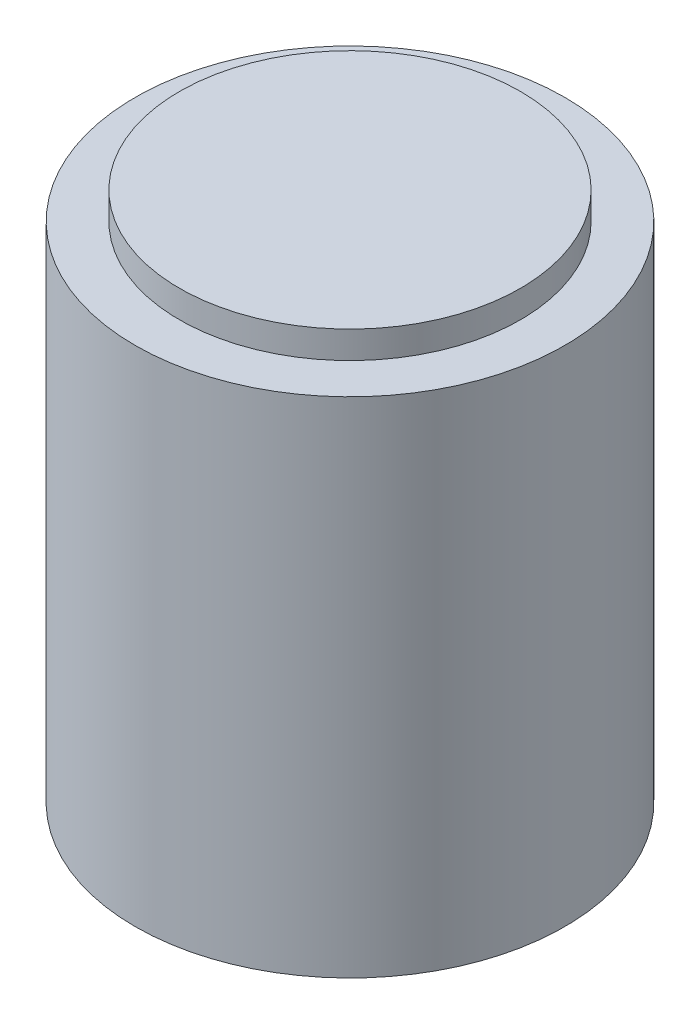
ISO-10303-21;
HEADER;
FILE_DESCRIPTION(('STEP AP214'),'2;1');
FILE_NAME('part.step','',(''),(''),'','','');
FILE_SCHEMA(('AUTOMOTIVE_DESIGN { 1 0 10303 214 1 1 1 1 }'));
ENDSEC;
DATA;
#1=APPLICATION_CONTEXT('core data for automotive mechanical design processes');
#2=APPLICATION_PROTOCOL_DEFINITION('international standard','automotive_design',2000,#1);
#3=PRODUCT_CONTEXT('',#1,'mechanical');
#4=PRODUCT('Part','Part','',(#3));
#5=PRODUCT_RELATED_PRODUCT_CATEGORY('part','',(#4));
#6=PRODUCT_DEFINITION_FORMATION('','',#4);
#7=PRODUCT_DEFINITION_CONTEXT('part definition',#1,'design');
#8=PRODUCT_DEFINITION('design','',#6,#7);
#9=PRODUCT_DEFINITION_SHAPE('','',#8);
#10=(LENGTH_UNIT() NAMED_UNIT(*) SI_UNIT(.MILLI.,.METRE.));
#11=(NAMED_UNIT(*) PLANE_ANGLE_UNIT() SI_UNIT($,.RADIAN.));
#12=(NAMED_UNIT(*) SI_UNIT($,.STERADIAN.) SOLID_ANGLE_UNIT());
#13=UNCERTAINTY_MEASURE_WITH_UNIT(LENGTH_MEASURE(1.E-05),#10,'distance_accuracy_value','');
#14=(GEOMETRIC_REPRESENTATION_CONTEXT(3) GLOBAL_UNCERTAINTY_ASSIGNED_CONTEXT((#13)) GLOBAL_UNIT_ASSIGNED_CONTEXT((#10,
#11,#12)) REPRESENTATION_CONTEXT('',''));
#15=CARTESIAN_POINT('',(0.,0.,0.));
#16=DIRECTION('',(0.,0.,1.));
#17=DIRECTION('',(1.,0.,0.));
#18=AXIS2_PLACEMENT_3D('',#15,#16,#17);
#19=CARTESIAN_POINT('',(0.,38.9,0.));
#20=DIRECTION('',(0.,1.,0.));
#21=DIRECTION('',(0.,0.,1.));
#22=AXIS2_PLACEMENT_3D('',#19,#20,#21);
#23=PLANE('',#22);
#24=CARTESIAN_POINT('',(0.,38.9,0.));
#25=DIRECTION('',(0.,-1.,0.));
#26=DIRECTION('',(0.,0.,-1.));
#27=AXIS2_PLACEMENT_3D('',#24,#25,#26);
#28=CIRCLE('',#27,12.5);
#29=CARTESIAN_POINT('',(0.,38.9,-12.5));
#30=VERTEX_POINT('',#29);
#31=EDGE_CURVE('E10',#30,#30,#28,.T.);
#32=ORIENTED_EDGE('',*,*,#31,.F.);
#33=EDGE_LOOP('',(#32));
#34=FACE_BOUND('',#33,.T.);
#35=ADVANCED_FACE('F31',(#34),#23,.T.);
#36=CARTESIAN_POINT('',(0.,0.,0.));
#37=DIRECTION('',(0.,-1.,0.));
#38=DIRECTION('',(0.,0.,-1.));
#39=AXIS2_PLACEMENT_3D('',#36,#37,#38);
#40=CYLINDRICAL_SURFACE('',#39,12.5);
#41=ORIENTED_EDGE('',*,*,#31,.T.);
#42=EDGE_LOOP('',(#41));
#43=FACE_BOUND('',#42,.T.);
#44=CARTESIAN_POINT('',(0.,36.9,0.));
#45=DIRECTION('',(0.,-1.,0.));
#46=DIRECTION('',(0.,0.,-1.));
#47=AXIS2_PLACEMENT_3D('',#44,#45,#46);
#48=CIRCLE('',#47,12.5);
#49=CARTESIAN_POINT('',(0.,36.9,-12.5));
#50=VERTEX_POINT('',#49);
#51=EDGE_CURVE('E37',#50,#50,#48,.T.);
#52=ORIENTED_EDGE('',*,*,#51,.F.);
#53=EDGE_LOOP('',(#52));
#54=FACE_BOUND('',#53,.T.);
#55=ADVANCED_FACE('F63',(#43,#54),#40,.T.);
#56=CARTESIAN_POINT('',(12.5,36.9,0.));
#57=DIRECTION('',(0.,1.,0.));
#58=DIRECTION('',(0.,0.,1.));
#59=AXIS2_PLACEMENT_3D('',#56,#57,#58);
#60=PLANE('',#59);
#61=ORIENTED_EDGE('',*,*,#51,.T.);
#62=EDGE_LOOP('',(#61));
#63=FACE_BOUND('',#62,.T.);
#64=CARTESIAN_POINT('',(0.,36.9,0.));
#65=DIRECTION('',(0.,-1.,0.));
#66=DIRECTION('',(0.,0.,-1.));
#67=AXIS2_PLACEMENT_3D('',#64,#65,#66);
#68=CIRCLE('',#67,15.75);
#69=CARTESIAN_POINT('',(0.,36.9,-15.75));
#70=VERTEX_POINT('',#69);
#71=EDGE_CURVE('E41',#70,#70,#68,.T.);
#72=ORIENTED_EDGE('',*,*,#71,.F.);
#73=EDGE_LOOP('',(#72));
#74=FACE_BOUND('',#73,.T.);
#75=ADVANCED_FACE('F55',(#63,#74),#60,.T.);
#76=CARTESIAN_POINT('',(0.,0.,0.));
#77=DIRECTION('',(0.,-1.,0.));
#78=DIRECTION('',(0.,0.,-1.));
#79=AXIS2_PLACEMENT_3D('',#76,#77,#78);
#80=CYLINDRICAL_SURFACE('',#79,15.75);
#81=ORIENTED_EDGE('',*,*,#71,.T.);
#82=EDGE_LOOP('',(#81));
#83=FACE_BOUND('',#82,.T.);
#84=CARTESIAN_POINT('',(0.,0.,0.));
#85=DIRECTION('',(0.,-1.,0.));
#86=DIRECTION('',(0.,0.,-1.));
#87=AXIS2_PLACEMENT_3D('',#84,#85,#86);
#88=CIRCLE('',#87,15.75);
#89=CARTESIAN_POINT('',(0.,0.,-15.75));
#90=VERTEX_POINT('',#89);
#91=EDGE_CURVE('E45',#90,#90,#88,.T.);
#92=ORIENTED_EDGE('',*,*,#91,.F.);
#93=EDGE_LOOP('',(#92));
#94=FACE_BOUND('',#93,.T.);
#95=ADVANCED_FACE('F53',(#83,#94),#80,.T.);
#96=CARTESIAN_POINT('',(15.75,0.,0.));
#97=DIRECTION('',(0.,-1.,0.));
#98=DIRECTION('',(0.,0.,-1.));
#99=AXIS2_PLACEMENT_3D('',#96,#97,#98);
#100=PLANE('',#99);
#101=ORIENTED_EDGE('',*,*,#91,.T.);
#102=EDGE_LOOP('',(#101));
#103=FACE_BOUND('',#102,.T.);
#104=ADVANCED_FACE('F51',(#103),#100,.T.);
#105=CLOSED_SHELL('',(#35,#55,#75,#95,#104));
#106=MANIFOLD_SOLID_BREP('B2',#105);
#107=ADVANCED_BREP_SHAPE_REPRESENTATION('',(#18,#106),#14);
#108=SHAPE_DEFINITION_REPRESENTATION(#9,#107);
ENDSEC;
END-ISO-10303-21;
